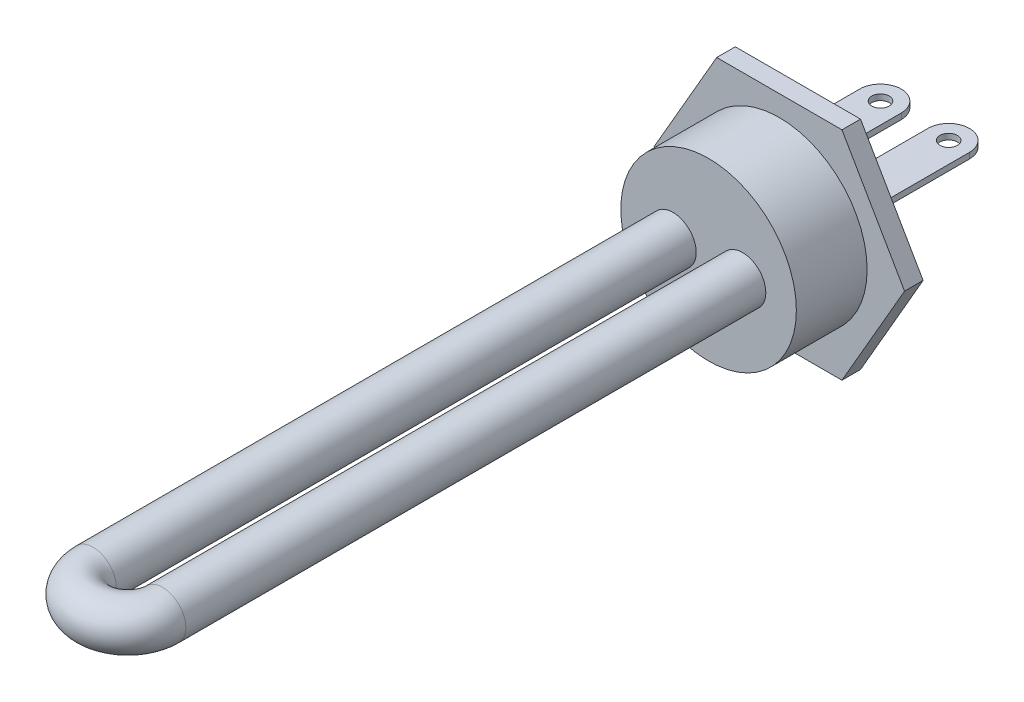
ISO-10303-21;
HEADER;
FILE_DESCRIPTION(('STEP AP214'),'2;1');
FILE_NAME('part.step','',(''),(''),'','','');
FILE_SCHEMA(('AUTOMOTIVE_DESIGN { 1 0 10303 214 1 1 1 1 }'));
ENDSEC;
DATA;
#1=APPLICATION_CONTEXT('core data for automotive mechanical design processes');
#2=APPLICATION_PROTOCOL_DEFINITION('international standard','automotive_design',2000,#1);
#3=PRODUCT_CONTEXT('',#1,'mechanical');
#4=PRODUCT('Part','Part','',(#3));
#5=PRODUCT_RELATED_PRODUCT_CATEGORY('part','',(#4));
#6=PRODUCT_DEFINITION_FORMATION('','',#4);
#7=PRODUCT_DEFINITION_CONTEXT('part definition',#1,'design');
#8=PRODUCT_DEFINITION('design','',#6,#7);
#9=PRODUCT_DEFINITION_SHAPE('','',#8);
#10=(LENGTH_UNIT() NAMED_UNIT(*) SI_UNIT(.MILLI.,.METRE.));
#11=(NAMED_UNIT(*) PLANE_ANGLE_UNIT() SI_UNIT($,.RADIAN.));
#12=(NAMED_UNIT(*) SI_UNIT($,.STERADIAN.) SOLID_ANGLE_UNIT());
#13=UNCERTAINTY_MEASURE_WITH_UNIT(LENGTH_MEASURE(1.E-05),#10,'distance_accuracy_value','');
#14=(GEOMETRIC_REPRESENTATION_CONTEXT(3) GLOBAL_UNCERTAINTY_ASSIGNED_CONTEXT((#13)) GLOBAL_UNIT_ASSIGNED_CONTEXT((#10,
#11,#12)) REPRESENTATION_CONTEXT('',''));
#15=CARTESIAN_POINT('',(0.,0.,0.));
#16=DIRECTION('',(0.,0.,1.));
#17=DIRECTION('',(1.,0.,0.));
#18=AXIS2_PLACEMENT_3D('',#15,#16,#17);
#19=CARTESIAN_POINT('',(9.46,2.,-23.7));
#20=DIRECTION('',(0.,1.,0.));
#21=DIRECTION('',(0.,0.,1.));
#22=AXIS2_PLACEMENT_3D('',#19,#20,#21);
#23=PLANE('',#22);
#24=CARTESIAN_POINT('',(5.88,2.,-20.12));
#25=DIRECTION('',(0.,1.,0.));
#26=DIRECTION('',(0.,0.,1.));
#27=AXIS2_PLACEMENT_3D('',#24,#25,#26);
#28=CIRCLE('',#27,1.5);
#29=CARTESIAN_POINT('',(5.88,2.,-18.62));
#30=VERTEX_POINT('',#29);
#31=EDGE_CURVE('E867',#30,#30,#28,.T.);
#32=ORIENTED_EDGE('',*,*,#31,.T.);
#33=EDGE_LOOP('',(#32));
#34=FACE_BOUND('',#33,.T.);
#35=CARTESIAN_POINT('',(5.88,2.,-20.12));
#36=DIRECTION('',(0.,1.,0.));
#37=DIRECTION('',(0.,0.,1.));
#38=AXIS2_PLACEMENT_3D('',#35,#36,#37);
#39=CIRCLE('',#38,3.58);
#40=CARTESIAN_POINT('',(9.46,2.,-20.12));
#41=VERTEX_POINT('',#40);
#42=CARTESIAN_POINT('',(2.3,2.,-20.12));
#43=VERTEX_POINT('',#42);
#44=EDGE_CURVE('E870',#41,#43,#39,.T.);
#45=ORIENTED_EDGE('',*,*,#44,.F.);
#46=DIRECTION('',(0.,0.,1.));
#47=VECTOR('',#46,1.);
#48=CARTESIAN_POINT('',(9.46,2.,-23.7));
#49=LINE('',#48,#47);
#50=CARTESIAN_POINT('',(9.46,2.,-5.7));
#51=VERTEX_POINT('',#50);
#52=EDGE_CURVE('E336',#41,#51,#49,.T.);
#53=ORIENTED_EDGE('',*,*,#52,.T.);
#54=DIRECTION('',(-1.,0.,0.));
#55=VECTOR('',#54,1.);
#56=CARTESIAN_POINT('',(9.46,2.,-5.7));
#57=LINE('',#56,#55);
#58=CARTESIAN_POINT('',(9.44410603363466,2.,-5.7));
#59=VERTEX_POINT('',#58);
#60=EDGE_CURVE('E311',#51,#59,#57,.T.);
#61=ORIENTED_EDGE('',*,*,#60,.T.);
#62=CARTESIAN_POINT('',(2.3,2.,-5.7));
#63=VERTEX_POINT('',#62);
#64=EDGE_CURVE('E316',#59,#63,#57,.T.);
#65=ORIENTED_EDGE('',*,*,#64,.T.);
#66=DIRECTION('',(0.,0.,1.));
#67=VECTOR('',#66,1.);
#68=CARTESIAN_POINT('',(2.3,2.,-23.7));
#69=LINE('',#68,#67);
#70=EDGE_CURVE('E333',#43,#63,#69,.T.);
#71=ORIENTED_EDGE('',*,*,#70,.F.);
#72=EDGE_LOOP('',(#45,#53,#61,#65,#71));
#73=FACE_BOUND('',#72,.T.);
#74=ADVANCED_FACE('F137',(#34,#73),#23,.F.);
#75=CARTESIAN_POINT('',(9.46,3.,-23.7));
#76=DIRECTION('',(0.,-1.,0.));
#77=DIRECTION('',(0.,0.,-1.));
#78=AXIS2_PLACEMENT_3D('',#75,#76,#77);
#79=PLANE('',#78);
#80=CARTESIAN_POINT('',(5.88,3.,-20.12));
#81=DIRECTION('',(0.,1.,0.));
#82=DIRECTION('',(0.,0.,1.));
#83=AXIS2_PLACEMENT_3D('',#80,#81,#82);
#84=CIRCLE('',#83,1.5);
#85=CARTESIAN_POINT('',(5.88,3.,-18.62));
#86=VERTEX_POINT('',#85);
#87=EDGE_CURVE('E287',#86,#86,#84,.T.);
#88=ORIENTED_EDGE('',*,*,#87,.F.);
#89=EDGE_LOOP('',(#88));
#90=FACE_BOUND('',#89,.T.);
#91=DIRECTION('',(0.,0.,1.));
#92=VECTOR('',#91,1.);
#93=CARTESIAN_POINT('',(9.46,3.,-23.7));
#94=LINE('',#93,#92);
#95=CARTESIAN_POINT('',(9.46,3.,-20.12));
#96=VERTEX_POINT('',#95);
#97=CARTESIAN_POINT('',(9.46,3.,-5.7));
#98=VERTEX_POINT('',#97);
#99=EDGE_CURVE('E326',#96,#98,#94,.T.);
#100=ORIENTED_EDGE('',*,*,#99,.F.);
#101=CARTESIAN_POINT('',(5.88,3.,-20.12));
#102=DIRECTION('',(0.,1.,0.));
#103=DIRECTION('',(0.,0.,1.));
#104=AXIS2_PLACEMENT_3D('',#101,#102,#103);
#105=CIRCLE('',#104,3.58);
#106=CARTESIAN_POINT('',(2.3,3.,-20.12));
#107=VERTEX_POINT('',#106);
#108=EDGE_CURVE('E909',#96,#107,#105,.T.);
#109=ORIENTED_EDGE('',*,*,#108,.T.);
#110=DIRECTION('',(0.,0.,1.));
#111=VECTOR('',#110,1.);
#112=CARTESIAN_POINT('',(2.3,3.,-23.7));
#113=LINE('',#112,#111);
#114=CARTESIAN_POINT('',(2.3,3.,-5.7));
#115=VERTEX_POINT('',#114);
#116=EDGE_CURVE('E330',#107,#115,#113,.T.);
#117=ORIENTED_EDGE('',*,*,#116,.T.);
#118=DIRECTION('',(1.,0.,0.));
#119=VECTOR('',#118,1.);
#120=CARTESIAN_POINT('',(9.46,3.,-5.7));
#121=LINE('',#120,#119);
#122=CARTESIAN_POINT('',(3.07036227750358,3.,-5.7));
#123=VERTEX_POINT('',#122);
#124=EDGE_CURVE('E322',#115,#123,#121,.T.);
#125=ORIENTED_EDGE('',*,*,#124,.T.);
#126=CARTESIAN_POINT('',(8.65963772249642,3.,-5.7));
#127=VERTEX_POINT('',#126);
#128=EDGE_CURVE('E327',#123,#127,#121,.T.);
#129=ORIENTED_EDGE('',*,*,#128,.T.);
#130=EDGE_CURVE('E321',#127,#98,#121,.T.);
#131=ORIENTED_EDGE('',*,*,#130,.T.);
#132=EDGE_LOOP('',(#100,#109,#117,#125,#129,#131));
#133=FACE_BOUND('',#132,.T.);
#134=ADVANCED_FACE('F532',(#90,#133),#79,.F.);
#135=CARTESIAN_POINT('',(-2.3,2.,-23.7));
#136=DIRECTION('',(0.,1.,0.));
#137=DIRECTION('',(0.,0.,1.));
#138=AXIS2_PLACEMENT_3D('',#135,#136,#137);
#139=PLANE('',#138);
#140=CARTESIAN_POINT('',(-5.88,2.,-20.12));
#141=DIRECTION('',(0.,1.,0.));
#142=DIRECTION('',(0.,0.,1.));
#143=AXIS2_PLACEMENT_3D('',#140,#141,#142);
#144=CIRCLE('',#143,1.5);
#145=CARTESIAN_POINT('',(-5.88,2.,-18.62));
#146=VERTEX_POINT('',#145);
#147=EDGE_CURVE('E877',#146,#146,#144,.T.);
#148=ORIENTED_EDGE('',*,*,#147,.T.);
#149=EDGE_LOOP('',(#148));
#150=FACE_BOUND('',#149,.T.);
#151=DIRECTION('',(0.,0.,1.));
#152=VECTOR('',#151,1.);
#153=CARTESIAN_POINT('',(-9.46,2.,-23.7));
#154=LINE('',#153,#152);
#155=CARTESIAN_POINT('',(-9.46,2.,-20.12));
#156=VERTEX_POINT('',#155);
#157=CARTESIAN_POINT('',(-9.46,2.,-5.7));
#158=VERTEX_POINT('',#157);
#159=EDGE_CURVE('E295',#156,#158,#154,.T.);
#160=ORIENTED_EDGE('',*,*,#159,.F.);
#161=CARTESIAN_POINT('',(-5.88,2.,-20.12));
#162=DIRECTION('',(0.,1.,0.));
#163=DIRECTION('',(0.,0.,1.));
#164=AXIS2_PLACEMENT_3D('',#161,#162,#163);
#165=CIRCLE('',#164,3.58);
#166=CARTESIAN_POINT('',(-2.3,2.,-20.12));
#167=VERTEX_POINT('',#166);
#168=EDGE_CURVE('E283',#167,#156,#165,.T.);
#169=ORIENTED_EDGE('',*,*,#168,.F.);
#170=DIRECTION('',(0.,0.,1.));
#171=VECTOR('',#170,1.);
#172=CARTESIAN_POINT('',(-2.3,2.,-23.7));
#173=LINE('',#172,#171);
#174=CARTESIAN_POINT('',(-2.3,2.,-5.7));
#175=VERTEX_POINT('',#174);
#176=EDGE_CURVE('E299',#167,#175,#173,.T.);
#177=ORIENTED_EDGE('',*,*,#176,.T.);
#178=DIRECTION('',(-1.,0.,0.));
#179=VECTOR('',#178,1.);
#180=CARTESIAN_POINT('',(-2.3,2.,-5.7));
#181=LINE('',#180,#179);
#182=CARTESIAN_POINT('',(-2.55589396636534,2.,-5.7));
#183=VERTEX_POINT('',#182);
#184=EDGE_CURVE('E875',#175,#183,#181,.T.);
#185=ORIENTED_EDGE('',*,*,#184,.T.);
#186=EDGE_CURVE('E153',#183,#158,#181,.T.);
#187=ORIENTED_EDGE('',*,*,#186,.T.);
#188=EDGE_LOOP('',(#160,#169,#177,#185,#187));
#189=FACE_BOUND('',#188,.T.);
#190=ADVANCED_FACE('F539',(#150,#189),#139,.F.);
#191=CARTESIAN_POINT('',(-2.3,3.,-23.7));
#192=DIRECTION('',(0.,-1.,0.));
#193=DIRECTION('',(0.,0.,-1.));
#194=AXIS2_PLACEMENT_3D('',#191,#192,#193);
#195=PLANE('',#194);
#196=CARTESIAN_POINT('',(-5.88,3.,-20.12));
#197=DIRECTION('',(0.,1.,0.));
#198=DIRECTION('',(0.,0.,1.));
#199=AXIS2_PLACEMENT_3D('',#196,#197,#198);
#200=CIRCLE('',#199,1.5);
#201=CARTESIAN_POINT('',(-5.88,3.,-18.62));
#202=VERTEX_POINT('',#201);
#203=EDGE_CURVE('E912',#202,#202,#200,.T.);
#204=ORIENTED_EDGE('',*,*,#203,.F.);
#205=EDGE_LOOP('',(#204));
#206=FACE_BOUND('',#205,.T.);
#207=CARTESIAN_POINT('',(-5.88,3.,-20.12));
#208=DIRECTION('',(0.,1.,0.));
#209=DIRECTION('',(0.,0.,1.));
#210=AXIS2_PLACEMENT_3D('',#207,#208,#209);
#211=CIRCLE('',#210,3.58);
#212=CARTESIAN_POINT('',(-2.3,3.,-20.12));
#213=VERTEX_POINT('',#212);
#214=CARTESIAN_POINT('',(-9.46,3.,-20.12));
#215=VERTEX_POINT('',#214);
#216=EDGE_CURVE('E264',#213,#215,#211,.T.);
#217=ORIENTED_EDGE('',*,*,#216,.T.);
#218=DIRECTION('',(0.,0.,1.));
#219=VECTOR('',#218,1.);
#220=CARTESIAN_POINT('',(-9.46,3.,-23.7));
#221=LINE('',#220,#219);
#222=CARTESIAN_POINT('',(-9.46,3.,-5.7));
#223=VERTEX_POINT('',#222);
#224=EDGE_CURVE('E269',#215,#223,#221,.T.);
#225=ORIENTED_EDGE('',*,*,#224,.T.);
#226=DIRECTION('',(1.,0.,0.));
#227=VECTOR('',#226,1.);
#228=CARTESIAN_POINT('',(-2.3,3.,-5.7));
#229=LINE('',#228,#227);
#230=CARTESIAN_POINT('',(-8.92963772249642,3.,-5.7));
#231=VERTEX_POINT('',#230);
#232=EDGE_CURVE('E301',#223,#231,#229,.T.);
#233=ORIENTED_EDGE('',*,*,#232,.T.);
#234=CARTESIAN_POINT('',(-3.34036227750357,3.,-5.7));
#235=VERTEX_POINT('',#234);
#236=EDGE_CURVE('E146',#231,#235,#229,.T.);
#237=ORIENTED_EDGE('',*,*,#236,.T.);
#238=CARTESIAN_POINT('',(-2.3,3.,-5.7));
#239=VERTEX_POINT('',#238);
#240=EDGE_CURVE('E886',#235,#239,#229,.T.);
#241=ORIENTED_EDGE('',*,*,#240,.T.);
#242=DIRECTION('',(0.,0.,1.));
#243=VECTOR('',#242,1.);
#244=CARTESIAN_POINT('',(-2.3,3.,-23.7));
#245=LINE('',#244,#243);
#246=EDGE_CURVE('E272',#213,#239,#245,.T.);
#247=ORIENTED_EDGE('',*,*,#246,.F.);
#248=EDGE_LOOP('',(#217,#225,#233,#237,#241,#247));
#249=FACE_BOUND('',#248,.T.);
#250=ADVANCED_FACE('F266',(#206,#249),#195,.F.);
#251=CARTESIAN_POINT('',(-9.46,3.,-23.7));
#252=DIRECTION('',(1.,0.,0.));
#253=DIRECTION('',(0.,0.,-1.));
#254=AXIS2_PLACEMENT_3D('',#251,#252,#253);
#255=PLANE('',#254);
#256=DIRECTION('',(0.,1.,0.));
#257=VECTOR('',#256,1.);
#258=CARTESIAN_POINT('',(-9.46,-18.7,-20.12));
#259=LINE('',#258,#257);
#260=EDGE_CURVE('E280',#156,#215,#259,.T.);
#261=ORIENTED_EDGE('',*,*,#260,.F.);
#262=ORIENTED_EDGE('',*,*,#159,.T.);
#263=DIRECTION('',(0.,1.,0.));
#264=VECTOR('',#263,1.);
#265=CARTESIAN_POINT('',(-9.46,3.,-5.7));
#266=LINE('',#265,#264);
#267=CARTESIAN_POINT('',(-9.46,2.39882783875792,-5.7));
#268=VERTEX_POINT('',#267);
#269=EDGE_CURVE('E884',#158,#268,#266,.T.);
#270=ORIENTED_EDGE('',*,*,#269,.T.);
#271=EDGE_CURVE('E292',#268,#223,#266,.T.);
#272=ORIENTED_EDGE('',*,*,#271,.T.);
#273=ORIENTED_EDGE('',*,*,#224,.F.);
#274=EDGE_LOOP('',(#261,#262,#270,#272,#273));
#275=FACE_BOUND('',#274,.T.);
#276=ADVANCED_FACE('F289',(#275),#255,.F.);
#277=CARTESIAN_POINT('',(2.3,3.,-23.7));
#278=DIRECTION('',(1.,0.,0.));
#279=DIRECTION('',(0.,0.,-1.));
#280=AXIS2_PLACEMENT_3D('',#277,#278,#279);
#281=PLANE('',#280);
#282=DIRECTION('',(0.,1.,0.));
#283=VECTOR('',#282,1.);
#284=CARTESIAN_POINT('',(2.3,-18.7,-20.12));
#285=LINE('',#284,#283);
#286=EDGE_CURVE('E277',#43,#107,#285,.T.);
#287=ORIENTED_EDGE('',*,*,#286,.F.);
#288=ORIENTED_EDGE('',*,*,#70,.T.);
#289=DIRECTION('',(0.,1.,0.));
#290=VECTOR('',#289,1.);
#291=CARTESIAN_POINT('',(2.3,3.,-5.7));
#292=LINE('',#291,#290);
#293=CARTESIAN_POINT('',(2.3,2.02503703669834,-5.7));
#294=VERTEX_POINT('',#293);
#295=EDGE_CURVE('E317',#63,#294,#292,.T.);
#296=ORIENTED_EDGE('',*,*,#295,.T.);
#297=EDGE_CURVE('E315',#294,#115,#292,.T.);
#298=ORIENTED_EDGE('',*,*,#297,.T.);
#299=ORIENTED_EDGE('',*,*,#116,.F.);
#300=EDGE_LOOP('',(#287,#288,#296,#298,#299));
#301=FACE_BOUND('',#300,.T.);
#302=ADVANCED_FACE('F546',(#301),#281,.F.);
#303=CARTESIAN_POINT('',(-6.135,0.,-5.7));
#304=DIRECTION('',(0.,0.,-1.));
#305=DIRECTION('',(-1.,0.,0.));
#306=AXIS2_PLACEMENT_3D('',#303,#304,#305);
#307=PLANE('',#306);
#308=ORIENTED_EDGE('',*,*,#236,.F.);
#309=CARTESIAN_POINT('',(-6.135,0.,-5.7));
#310=DIRECTION('',(0.,0.,-1.));
#311=DIRECTION('',(-1.,0.,0.));
#312=AXIS2_PLACEMENT_3D('',#309,#310,#311);
#313=CIRCLE('',#312,4.1);
#314=EDGE_CURVE('E345',#231,#235,#313,.T.);
#315=ORIENTED_EDGE('',*,*,#314,.T.);
#316=EDGE_LOOP('',(#308,#315));
#317=FACE_BOUND('',#316,.T.);
#318=ADVANCED_FACE('F558',(#317),#307,.T.);
#319=CARTESIAN_POINT('',(5.865,0.,-5.7));
#320=DIRECTION('',(0.,0.,-1.));
#321=DIRECTION('',(-1.,0.,0.));
#322=AXIS2_PLACEMENT_3D('',#319,#320,#321);
#323=PLANE('',#322);
#324=ORIENTED_EDGE('',*,*,#128,.F.);
#325=CARTESIAN_POINT('',(5.865,0.,-5.7));
#326=DIRECTION('',(0.,0.,-1.));
#327=DIRECTION('',(-1.,0.,0.));
#328=AXIS2_PLACEMENT_3D('',#325,#326,#327);
#329=CIRCLE('',#328,4.1);
#330=EDGE_CURVE('E355',#123,#127,#329,.T.);
#331=ORIENTED_EDGE('',*,*,#330,.T.);
#332=EDGE_LOOP('',(#324,#331));
#333=FACE_BOUND('',#332,.T.);
#334=ADVANCED_FACE('F571',(#333),#323,.T.);
#335=CARTESIAN_POINT('',(-10.796450033846,-18.7,3.2));
#336=DIRECTION('',(0.,1.,0.));
#337=DIRECTION('',(0.,0.,1.));
#338=AXIS2_PLACEMENT_3D('',#335,#336,#337);
#339=PLANE('',#338);
#340=DIRECTION('',(1.,0.,0.));
#341=VECTOR('',#340,1.);
#342=CARTESIAN_POINT('',(-10.796450033846,-18.7,0.));
#343=LINE('',#342,#341);
#344=CARTESIAN_POINT('',(-10.796450033846,-18.7,0.));
#345=VERTEX_POINT('',#344);
#346=CARTESIAN_POINT('',(10.796450033846,-18.7,0.));
#347=VERTEX_POINT('',#346);
#348=EDGE_CURVE('E396',#345,#347,#343,.T.);
#349=ORIENTED_EDGE('',*,*,#348,.T.);
#350=DIRECTION('',(0.,0.,-1.));
#351=VECTOR('',#350,1.);
#352=CARTESIAN_POINT('',(10.796450033846,-18.7,3.2));
#353=LINE('',#352,#351);
#354=CARTESIAN_POINT('',(10.796450033846,-18.7,3.2));
#355=VERTEX_POINT('',#354);
#356=EDGE_CURVE('E402',#355,#347,#353,.T.);
#357=ORIENTED_EDGE('',*,*,#356,.F.);
#358=DIRECTION('',(1.,0.,0.));
#359=VECTOR('',#358,1.);
#360=CARTESIAN_POINT('',(-10.796450033846,-18.7,3.2));
#361=LINE('',#360,#359);
#362=CARTESIAN_POINT('',(-10.796450033846,-18.7,3.2));
#363=VERTEX_POINT('',#362);
#364=EDGE_CURVE('E403',#363,#355,#361,.T.);
#365=ORIENTED_EDGE('',*,*,#364,.F.);
#366=DIRECTION('',(0.,0.,-1.));
#367=VECTOR('',#366,1.);
#368=CARTESIAN_POINT('',(-10.796450033846,-18.7,3.2));
#369=LINE('',#368,#367);
#370=EDGE_CURVE('E423',#363,#345,#369,.T.);
#371=ORIENTED_EDGE('',*,*,#370,.T.);
#372=EDGE_LOOP('',(#349,#357,#365,#371));
#373=FACE_BOUND('',#372,.T.);
#374=ADVANCED_FACE('F139',(#373),#339,.F.);
#375=CARTESIAN_POINT('',(10.796450033846,-18.7,3.2));
#376=DIRECTION('',(-0.866025403784438,0.5,0.));
#377=DIRECTION('',(-0.5,-0.866025403784439,0.));
#378=AXIS2_PLACEMENT_3D('',#375,#376,#377);
#379=PLANE('',#378);
#380=DIRECTION('',(0.5,0.866025403784438,0.));
#381=VECTOR('',#380,1.);
#382=CARTESIAN_POINT('',(10.796450033846,-18.7,0.));
#383=LINE('',#382,#381);
#384=CARTESIAN_POINT('',(21.592900067692,0.,0.));
#385=VERTEX_POINT('',#384);
#386=EDGE_CURVE('E427',#347,#385,#383,.T.);
#387=ORIENTED_EDGE('',*,*,#386,.T.);
#388=DIRECTION('',(0.,0.,-1.));
#389=VECTOR('',#388,1.);
#390=CARTESIAN_POINT('',(21.592900067692,0.,3.2));
#391=LINE('',#390,#389);
#392=CARTESIAN_POINT('',(21.592900067692,0.,3.2));
#393=VERTEX_POINT('',#392);
#394=EDGE_CURVE('E456',#393,#385,#391,.T.);
#395=ORIENTED_EDGE('',*,*,#394,.F.);
#396=DIRECTION('',(0.5,0.866025403784438,0.));
#397=VECTOR('',#396,1.);
#398=CARTESIAN_POINT('',(10.796450033846,-18.7,3.2));
#399=LINE('',#398,#397);
#400=EDGE_CURVE('E407',#355,#393,#399,.T.);
#401=ORIENTED_EDGE('',*,*,#400,.F.);
#402=ORIENTED_EDGE('',*,*,#356,.T.);
#403=EDGE_LOOP('',(#387,#395,#401,#402));
#404=FACE_BOUND('',#403,.T.);
#405=ADVANCED_FACE('F520',(#404),#379,.F.);
#406=CARTESIAN_POINT('',(21.592900067692,0.,3.2));
#407=DIRECTION('',(-0.866025403784438,-0.5,0.));
#408=DIRECTION('',(0.5,-0.866025403784439,0.));
#409=AXIS2_PLACEMENT_3D('',#406,#407,#408);
#410=PLANE('',#409);
#411=DIRECTION('',(-0.5,0.866025403784438,0.));
#412=VECTOR('',#411,1.);
#413=CARTESIAN_POINT('',(21.592900067692,0.,0.));
#414=LINE('',#413,#412);
#415=CARTESIAN_POINT('',(10.796450033846,18.7,0.));
#416=VERTEX_POINT('',#415);
#417=EDGE_CURVE('E430',#385,#416,#414,.T.);
#418=ORIENTED_EDGE('',*,*,#417,.T.);
#419=DIRECTION('',(0.,0.,-1.));
#420=VECTOR('',#419,1.);
#421=CARTESIAN_POINT('',(10.796450033846,18.7,3.2));
#422=LINE('',#421,#420);
#423=CARTESIAN_POINT('',(10.796450033846,18.7,3.2));
#424=VERTEX_POINT('',#423);
#425=EDGE_CURVE('E452',#424,#416,#422,.T.);
#426=ORIENTED_EDGE('',*,*,#425,.F.);
#427=DIRECTION('',(-0.5,0.866025403784438,0.));
#428=VECTOR('',#427,1.);
#429=CARTESIAN_POINT('',(21.592900067692,0.,3.2));
#430=LINE('',#429,#428);
#431=EDGE_CURVE('E411',#393,#424,#430,.T.);
#432=ORIENTED_EDGE('',*,*,#431,.F.);
#433=ORIENTED_EDGE('',*,*,#394,.T.);
#434=EDGE_LOOP('',(#418,#426,#432,#433));
#435=FACE_BOUND('',#434,.T.);
#436=ADVANCED_FACE('F517',(#435),#410,.F.);
#437=CARTESIAN_POINT('',(10.796450033846,18.7,3.2));
#438=DIRECTION('',(0.,-1.,0.));
#439=DIRECTION('',(0.,0.,-1.));
#440=AXIS2_PLACEMENT_3D('',#437,#438,#439);
#441=PLANE('',#440);
#442=DIRECTION('',(-1.,0.,0.));
#443=VECTOR('',#442,1.);
#444=CARTESIAN_POINT('',(10.796450033846,18.7,0.));
#445=LINE('',#444,#443);
#446=CARTESIAN_POINT('',(-10.796450033846,18.7,0.));
#447=VERTEX_POINT('',#446);
#448=EDGE_CURVE('E433',#416,#447,#445,.T.);
#449=ORIENTED_EDGE('',*,*,#448,.T.);
#450=DIRECTION('',(0.,0.,-1.));
#451=VECTOR('',#450,1.);
#452=CARTESIAN_POINT('',(-10.796450033846,18.7,3.2));
#453=LINE('',#452,#451);
#454=CARTESIAN_POINT('',(-10.796450033846,18.7,3.2));
#455=VERTEX_POINT('',#454);
#456=EDGE_CURVE('E448',#455,#447,#453,.T.);
#457=ORIENTED_EDGE('',*,*,#456,.F.);
#458=DIRECTION('',(-1.,0.,0.));
#459=VECTOR('',#458,1.);
#460=CARTESIAN_POINT('',(10.796450033846,18.7,3.2));
#461=LINE('',#460,#459);
#462=EDGE_CURVE('E414',#424,#455,#461,.T.);
#463=ORIENTED_EDGE('',*,*,#462,.F.);
#464=ORIENTED_EDGE('',*,*,#425,.T.);
#465=EDGE_LOOP('',(#449,#457,#463,#464));
#466=FACE_BOUND('',#465,.T.);
#467=ADVANCED_FACE('F512',(#466),#441,.F.);
#468=CARTESIAN_POINT('',(-10.796450033846,18.7,3.2));
#469=DIRECTION('',(0.866025403784439,-0.5,0.));
#470=DIRECTION('',(0.5,0.866025403784439,0.));
#471=AXIS2_PLACEMENT_3D('',#468,#469,#470);
#472=PLANE('',#471);
#473=DIRECTION('',(-0.5,-0.866025403784439,0.));
#474=VECTOR('',#473,1.);
#475=CARTESIAN_POINT('',(-10.796450033846,18.7,0.));
#476=LINE('',#475,#474);
#477=CARTESIAN_POINT('',(-21.592900067692,0.,0.));
#478=VERTEX_POINT('',#477);
#479=EDGE_CURVE('E436',#447,#478,#476,.T.);
#480=ORIENTED_EDGE('',*,*,#479,.T.);
#481=DIRECTION('',(0.,0.,-1.));
#482=VECTOR('',#481,1.);
#483=CARTESIAN_POINT('',(-21.592900067692,0.,3.2));
#484=LINE('',#483,#482);
#485=CARTESIAN_POINT('',(-21.592900067692,0.,3.2));
#486=VERTEX_POINT('',#485);
#487=EDGE_CURVE('E444',#486,#478,#484,.T.);
#488=ORIENTED_EDGE('',*,*,#487,.F.);
#489=DIRECTION('',(-0.5,-0.866025403784439,0.));
#490=VECTOR('',#489,1.);
#491=CARTESIAN_POINT('',(-10.796450033846,18.7,3.2));
#492=LINE('',#491,#490);
#493=EDGE_CURVE('E417',#455,#486,#492,.T.);
#494=ORIENTED_EDGE('',*,*,#493,.F.);
#495=ORIENTED_EDGE('',*,*,#456,.T.);
#496=EDGE_LOOP('',(#480,#488,#494,#495));
#497=FACE_BOUND('',#496,.T.);
#498=ADVANCED_FACE('F508',(#497),#472,.F.);
#499=CARTESIAN_POINT('',(-21.592900067692,0.,3.2));
#500=DIRECTION('',(0.866025403784439,0.5,0.));
#501=DIRECTION('',(-0.5,0.866025403784439,0.));
#502=AXIS2_PLACEMENT_3D('',#499,#500,#501);
#503=PLANE('',#502);
#504=DIRECTION('',(0.5,-0.866025403784439,0.));
#505=VECTOR('',#504,1.);
#506=CARTESIAN_POINT('',(-21.592900067692,0.,0.));
#507=LINE('',#506,#505);
#508=EDGE_CURVE('E408',#478,#345,#507,.T.);
#509=ORIENTED_EDGE('',*,*,#508,.T.);
#510=ORIENTED_EDGE('',*,*,#370,.F.);
#511=DIRECTION('',(0.5,-0.866025403784439,0.));
#512=VECTOR('',#511,1.);
#513=CARTESIAN_POINT('',(-21.592900067692,0.,3.2));
#514=LINE('',#513,#512);
#515=EDGE_CURVE('E420',#486,#363,#514,.T.);
#516=ORIENTED_EDGE('',*,*,#515,.F.);
#517=ORIENTED_EDGE('',*,*,#487,.T.);
#518=EDGE_LOOP('',(#509,#510,#516,#517));
#519=FACE_BOUND('',#518,.T.);
#520=ADVANCED_FACE('F504',(#519),#503,.F.);
#521=CARTESIAN_POINT('',(0.,0.,3.2));
#522=DIRECTION('',(0.,0.,1.));
#523=DIRECTION('',(1.,0.,0.));
#524=AXIS2_PLACEMENT_3D('',#521,#522,#523);
#525=PLANE('',#524);
#526=CARTESIAN_POINT('',(0.,0.,3.2));
#527=DIRECTION('',(0.,0.,1.));
#528=DIRECTION('',(1.,0.,0.));
#529=AXIS2_PLACEMENT_3D('',#526,#527,#528);
#530=CIRCLE('',#529,15.135);
#531=CARTESIAN_POINT('',(15.135,0.,3.2));
#532=VERTEX_POINT('',#531);
#533=EDGE_CURVE('E397',#532,#532,#530,.T.);
#534=ORIENTED_EDGE('',*,*,#533,.F.);
#535=EDGE_LOOP('',(#534));
#536=FACE_BOUND('',#535,.T.);
#537=ORIENTED_EDGE('',*,*,#364,.T.);
#538=ORIENTED_EDGE('',*,*,#400,.T.);
#539=ORIENTED_EDGE('',*,*,#431,.T.);
#540=ORIENTED_EDGE('',*,*,#462,.T.);
#541=ORIENTED_EDGE('',*,*,#493,.T.);
#542=ORIENTED_EDGE('',*,*,#515,.T.);
#543=EDGE_LOOP('',(#537,#538,#539,#540,#541,#542));
#544=FACE_BOUND('',#543,.T.);
#545=ADVANCED_FACE('F492',(#536,#544),#525,.T.);
#546=CARTESIAN_POINT('',(0.,0.,0.));
#547=DIRECTION('',(0.,0.,1.));
#548=DIRECTION('',(1.,0.,0.));
#549=AXIS2_PLACEMENT_3D('',#546,#547,#548);
#550=PLANE('',#549);
#551=CARTESIAN_POINT('',(0.,0.,0.));
#552=DIRECTION('',(0.,0.,-1.));
#553=DIRECTION('',(-1.,0.,0.));
#554=AXIS2_PLACEMENT_3D('',#551,#552,#553);
#555=CIRCLE('',#554,13.5);
#556=CARTESIAN_POINT('',(-13.5,0.,0.));
#557=VERTEX_POINT('',#556);
#558=EDGE_CURVE('E375',#557,#557,#555,.T.);
#559=ORIENTED_EDGE('',*,*,#558,.F.);
#560=EDGE_LOOP('',(#559));
#561=FACE_BOUND('',#560,.T.);
#562=ORIENTED_EDGE('',*,*,#348,.F.);
#563=ORIENTED_EDGE('',*,*,#508,.F.);
#564=ORIENTED_EDGE('',*,*,#479,.F.);
#565=ORIENTED_EDGE('',*,*,#448,.F.);
#566=ORIENTED_EDGE('',*,*,#417,.F.);
#567=ORIENTED_EDGE('',*,*,#386,.F.);
#568=EDGE_LOOP('',(#562,#563,#564,#565,#566,#567));
#569=FACE_BOUND('',#568,.T.);
#570=ADVANCED_FACE('F488',(#561,#569),#550,.F.);
#571=CARTESIAN_POINT('',(0.,0.,15.4));
#572=DIRECTION('',(0.,0.,-1.));
#573=DIRECTION('',(-1.,0.,0.));
#574=AXIS2_PLACEMENT_3D('',#571,#572,#573);
#575=CYLINDRICAL_SURFACE('',#574,15.135);
#576=CARTESIAN_POINT('',(0.,0.,15.4));
#577=DIRECTION('',(0.,0.,1.));
#578=DIRECTION('',(1.,0.,0.));
#579=AXIS2_PLACEMENT_3D('',#576,#577,#578);
#580=CIRCLE('',#579,15.135);
#581=CARTESIAN_POINT('',(15.135,0.,15.4));
#582=VERTEX_POINT('',#581);
#583=EDGE_CURVE('E389',#582,#582,#580,.T.);
#584=ORIENTED_EDGE('',*,*,#583,.F.);
#585=EDGE_LOOP('',(#584));
#586=FACE_BOUND('',#585,.T.);
#587=ORIENTED_EDGE('',*,*,#533,.T.);
#588=EDGE_LOOP('',(#587));
#589=FACE_BOUND('',#588,.T.);
#590=ADVANCED_FACE('F491',(#586,#589),#575,.T.);
#591=CARTESIAN_POINT('',(0.,0.,15.4));
#592=DIRECTION('',(0.,0.,1.));
#593=DIRECTION('',(1.,0.,0.));
#594=AXIS2_PLACEMENT_3D('',#591,#592,#593);
#595=PLANE('',#594);
#596=CARTESIAN_POINT('',(5.865,0.,15.4));
#597=DIRECTION('',(0.,0.,1.));
#598=DIRECTION('',(1.,0.,0.));
#599=AXIS2_PLACEMENT_3D('',#596,#597,#598);
#600=CIRCLE('',#599,4.);
#601=CARTESIAN_POINT('',(9.865,0.,15.4));
#602=VERTEX_POINT('',#601);
#603=EDGE_CURVE('E380',#602,#602,#600,.T.);
#604=ORIENTED_EDGE('',*,*,#603,.F.);
#605=EDGE_LOOP('',(#604));
#606=FACE_BOUND('',#605,.T.);
#607=CARTESIAN_POINT('',(-6.135,0.,15.4));
#608=DIRECTION('',(0.,0.,1.));
#609=DIRECTION('',(1.,0.,0.));
#610=AXIS2_PLACEMENT_3D('',#607,#608,#609);
#611=CIRCLE('',#610,4.);
#612=CARTESIAN_POINT('',(-2.135,0.,15.4));
#613=VERTEX_POINT('',#612);
#614=EDGE_CURVE('E376',#613,#613,#611,.T.);
#615=ORIENTED_EDGE('',*,*,#614,.F.);
#616=EDGE_LOOP('',(#615));
#617=FACE_BOUND('',#616,.T.);
#618=ORIENTED_EDGE('',*,*,#583,.T.);
#619=EDGE_LOOP('',(#618));
#620=FACE_BOUND('',#619,.T.);
#621=ADVANCED_FACE('F484',(#606,#617,#620),#595,.T.);
#622=CARTESIAN_POINT('',(0.,0.,12.8));
#623=DIRECTION('',(0.,0.,-1.));
#624=DIRECTION('',(-1.,0.,0.));
#625=AXIS2_PLACEMENT_3D('',#622,#623,#624);
#626=CYLINDRICAL_SURFACE('',#625,13.5);
#627=CARTESIAN_POINT('',(0.,0.,12.8));
#628=DIRECTION('',(0.,0.,-1.));
#629=DIRECTION('',(-1.,0.,0.));
#630=AXIS2_PLACEMENT_3D('',#627,#628,#629);
#631=CIRCLE('',#630,13.5);
#632=CARTESIAN_POINT('',(-13.5,0.,12.8));
#633=VERTEX_POINT('',#632);
#634=EDGE_CURVE('E385',#633,#633,#631,.T.);
#635=ORIENTED_EDGE('',*,*,#634,.F.);
#636=EDGE_LOOP('',(#635));
#637=FACE_BOUND('',#636,.T.);
#638=ORIENTED_EDGE('',*,*,#558,.T.);
#639=EDGE_LOOP('',(#638));
#640=FACE_BOUND('',#639,.T.);
#641=ADVANCED_FACE('F476',(#637,#640),#626,.F.);
#642=CARTESIAN_POINT('',(0.,0.,12.8));
#643=DIRECTION('',(0.,0.,-1.));
#644=DIRECTION('',(-1.,0.,0.));
#645=AXIS2_PLACEMENT_3D('',#642,#643,#644);
#646=PLANE('',#645);
#647=CARTESIAN_POINT('',(5.865,0.,12.8));
#648=DIRECTION('',(0.,0.,-1.));
#649=DIRECTION('',(-1.,0.,0.));
#650=AXIS2_PLACEMENT_3D('',#647,#648,#649);
#651=CIRCLE('',#650,4.);
#652=CARTESIAN_POINT('',(1.865,0.,12.8));
#653=VERTEX_POINT('',#652);
#654=EDGE_CURVE('E381',#653,#653,#651,.T.);
#655=ORIENTED_EDGE('',*,*,#654,.F.);
#656=EDGE_LOOP('',(#655));
#657=FACE_BOUND('',#656,.T.);
#658=CARTESIAN_POINT('',(-6.135,0.,12.8));
#659=DIRECTION('',(0.,0.,-1.));
#660=DIRECTION('',(-1.,0.,0.));
#661=AXIS2_PLACEMENT_3D('',#658,#659,#660);
#662=CIRCLE('',#661,4.);
#663=CARTESIAN_POINT('',(-10.135,0.,12.8));
#664=VERTEX_POINT('',#663);
#665=EDGE_CURVE('E401',#664,#664,#662,.T.);
#666=ORIENTED_EDGE('',*,*,#665,.F.);
#667=EDGE_LOOP('',(#666));
#668=FACE_BOUND('',#667,.T.);
#669=ORIENTED_EDGE('',*,*,#634,.T.);
#670=EDGE_LOOP('',(#669));
#671=FACE_BOUND('',#670,.T.);
#672=ADVANCED_FACE('F472',(#657,#668,#671),#646,.T.);
#673=CARTESIAN_POINT('',(-6.13499999999999,0.,115.4));
#674=DIRECTION('',(0.,0.,-1.));
#675=DIRECTION('',(-1.,0.,0.));
#676=AXIS2_PLACEMENT_3D('',#673,#674,#675);
#677=CYLINDRICAL_SURFACE('',#676,4.);
#678=ORIENTED_EDGE('',*,*,#665,.T.);
#679=EDGE_LOOP('',(#678));
#680=FACE_BOUND('',#679,.T.);
#681=CARTESIAN_POINT('',(-6.135,0.,0.));
#682=DIRECTION('',(0.,0.,-1.));
#683=DIRECTION('',(-1.,0.,0.));
#684=AXIS2_PLACEMENT_3D('',#681,#682,#683);
#685=CIRCLE('',#684,4.);
#686=CARTESIAN_POINT('',(-10.135,0.,0.));
#687=VERTEX_POINT('',#686);
#688=EDGE_CURVE('E371',#687,#687,#685,.T.);
#689=ORIENTED_EDGE('',*,*,#688,.F.);
#690=EDGE_LOOP('',(#689));
#691=FACE_BOUND('',#690,.T.);
#692=ADVANCED_FACE('F475',(#680,#691),#677,.T.);
#693=CARTESIAN_POINT('',(5.865,0.,0.));
#694=DIRECTION('',(0.,0.,1.));
#695=DIRECTION('',(1.,0.,0.));
#696=AXIS2_PLACEMENT_3D('',#693,#694,#695);
#697=CYLINDRICAL_SURFACE('',#696,4.);
#698=ORIENTED_EDGE('',*,*,#654,.T.);
#699=EDGE_LOOP('',(#698));
#700=FACE_BOUND('',#699,.T.);
#701=CARTESIAN_POINT('',(5.865,0.,0.));
#702=DIRECTION('',(0.,0.,1.));
#703=DIRECTION('',(1.,0.,0.));
#704=AXIS2_PLACEMENT_3D('',#701,#702,#703);
#705=CIRCLE('',#704,4.);
#706=CARTESIAN_POINT('',(9.865,0.,0.));
#707=VERTEX_POINT('',#706);
#708=EDGE_CURVE('E354',#707,#707,#705,.T.);
#709=ORIENTED_EDGE('',*,*,#708,.T.);
#710=EDGE_LOOP('',(#709));
#711=FACE_BOUND('',#710,.T.);
#712=ADVANCED_FACE('F469',(#700,#711),#697,.T.);
#713=ORIENTED_EDGE('',*,*,#603,.T.);
#714=EDGE_LOOP('',(#713));
#715=FACE_BOUND('',#714,.T.);
#716=CARTESIAN_POINT('',(5.86500000000002,0.,115.4));
#717=DIRECTION('',(0.,0.,1.));
#718=DIRECTION('',(1.,0.,0.));
#719=AXIS2_PLACEMENT_3D('',#716,#717,#718);
#720=CIRCLE('',#719,4.);
#721=CARTESIAN_POINT('',(9.86500000000001,0.,115.4));
#722=VERTEX_POINT('',#721);
#723=EDGE_CURVE('E363',#722,#722,#720,.T.);
#724=ORIENTED_EDGE('',*,*,#723,.F.);
#725=EDGE_LOOP('',(#724));
#726=FACE_BOUND('',#725,.T.);
#727=ADVANCED_FACE('F581',(#715,#726),#697,.T.);
#728=ORIENTED_EDGE('',*,*,#614,.T.);
#729=EDGE_LOOP('',(#728));
#730=FACE_BOUND('',#729,.T.);
#731=CARTESIAN_POINT('',(-6.13499999999999,0.,115.4));
#732=DIRECTION('',(0.,0.,-1.));
#733=DIRECTION('',(-1.,0.,0.));
#734=AXIS2_PLACEMENT_3D('',#731,#732,#733);
#735=CIRCLE('',#734,4.);
#736=CARTESIAN_POINT('',(-10.135,0.,115.4));
#737=VERTEX_POINT('',#736);
#738=EDGE_CURVE('E367',#737,#737,#735,.T.);
#739=ORIENTED_EDGE('',*,*,#738,.T.);
#740=EDGE_LOOP('',(#739));
#741=FACE_BOUND('',#740,.T.);
#742=ADVANCED_FACE('F584',(#730,#741),#677,.T.);
#743=CARTESIAN_POINT('',(-0.134999999999986,0.,115.4));
#744=DIRECTION('',(0.,-1.,0.));
#745=DIRECTION('',(0.,0.,-1.));
#746=AXIS2_PLACEMENT_3D('',#743,#744,#745);
#747=TOROIDAL_SURFACE('',#746,6.,4.);
#748=CARTESIAN_POINT('',(-0.134999999999986,0.,115.4));
#749=DIRECTION('',(0.,-1.,0.));
#750=DIRECTION('',(0.,0.,-1.));
#751=AXIS2_PLACEMENT_3D('',#748,#749,#750);
#752=CIRCLE('',#751,10.);
#753=EDGE_CURVE('',#722,#737,#752,.T.);
#754=ORIENTED_EDGE('',*,*,#723,.T.);
#755=ORIENTED_EDGE('',*,*,#738,.F.);
#756=ORIENTED_EDGE('',*,*,#753,.T.);
#757=ORIENTED_EDGE('',*,*,#753,.F.);
#758=EDGE_LOOP('',(#754,#756,#755,#757));
#759=FACE_BOUND('',#758,.T.);
#760=ADVANCED_FACE('F577',(#759),#747,.T.);
#761=CARTESIAN_POINT('',(5.865,0.,-5.7));
#762=DIRECTION('',(0.,0.,1.));
#763=DIRECTION('',(1.,0.,0.));
#764=AXIS2_PLACEMENT_3D('',#761,#762,#763);
#765=CYLINDRICAL_SURFACE('',#764,4.1);
#766=EDGE_CURVE('E350',#294,#123,#329,.T.);
#767=ORIENTED_EDGE('',*,*,#766,.F.);
#768=EDGE_CURVE('E356',#59,#294,#329,.T.);
#769=ORIENTED_EDGE('',*,*,#768,.F.);
#770=EDGE_CURVE('E940',#127,#59,#329,.T.);
#771=ORIENTED_EDGE('',*,*,#770,.F.);
#772=ORIENTED_EDGE('',*,*,#330,.F.);
#773=EDGE_LOOP('',(#767,#769,#771,#772));
#774=FACE_BOUND('',#773,.T.);
#775=CARTESIAN_POINT('',(5.865,0.,0.));
#776=DIRECTION('',(0.,0.,-1.));
#777=DIRECTION('',(-1.,0.,0.));
#778=AXIS2_PLACEMENT_3D('',#775,#776,#777);
#779=CIRCLE('',#778,4.1);
#780=CARTESIAN_POINT('',(1.765,0.,0.));
#781=VERTEX_POINT('',#780);
#782=EDGE_CURVE('E344',#781,#781,#779,.T.);
#783=ORIENTED_EDGE('',*,*,#782,.T.);
#784=EDGE_LOOP('',(#783));
#785=FACE_BOUND('',#784,.T.);
#786=ADVANCED_FACE('F569',(#774,#785),#765,.T.);
#787=ORIENTED_EDGE('',*,*,#295,.F.);
#788=ORIENTED_EDGE('',*,*,#64,.F.);
#789=ORIENTED_EDGE('',*,*,#768,.T.);
#790=EDGE_LOOP('',(#787,#788,#789));
#791=FACE_BOUND('',#790,.T.);
#792=ADVANCED_FACE('F566',(#791),#323,.T.);
#793=CARTESIAN_POINT('',(5.865,0.,0.));
#794=DIRECTION('',(0.,0.,-1.));
#795=DIRECTION('',(-1.,0.,0.));
#796=AXIS2_PLACEMENT_3D('',#793,#794,#795);
#797=PLANE('',#796);
#798=ORIENTED_EDGE('',*,*,#708,.F.);
#799=EDGE_LOOP('',(#798));
#800=FACE_BOUND('',#799,.T.);
#801=ORIENTED_EDGE('',*,*,#782,.F.);
#802=EDGE_LOOP('',(#801));
#803=FACE_BOUND('',#802,.T.);
#804=ADVANCED_FACE('F565',(#800,#803),#797,.F.);
#805=CARTESIAN_POINT('',(-6.135,0.,-5.7));
#806=DIRECTION('',(0.,0.,1.));
#807=DIRECTION('',(1.,0.,0.));
#808=AXIS2_PLACEMENT_3D('',#805,#806,#807);
#809=CYLINDRICAL_SURFACE('',#808,4.1);
#810=EDGE_CURVE('E340',#268,#231,#313,.T.);
#811=ORIENTED_EDGE('',*,*,#810,.F.);
#812=EDGE_CURVE('E346',#183,#268,#313,.T.);
#813=ORIENTED_EDGE('',*,*,#812,.F.);
#814=EDGE_CURVE('E160',#235,#183,#313,.T.);
#815=ORIENTED_EDGE('',*,*,#814,.F.);
#816=ORIENTED_EDGE('',*,*,#314,.F.);
#817=EDGE_LOOP('',(#811,#813,#815,#816));
#818=FACE_BOUND('',#817,.T.);
#819=CARTESIAN_POINT('',(-6.135,0.,0.));
#820=DIRECTION('',(0.,0.,-1.));
#821=DIRECTION('',(-1.,0.,0.));
#822=AXIS2_PLACEMENT_3D('',#819,#820,#821);
#823=CIRCLE('',#822,4.1);
#824=CARTESIAN_POINT('',(-10.235,0.,0.));
#825=VERTEX_POINT('',#824);
#826=EDGE_CURVE('E339',#825,#825,#823,.T.);
#827=ORIENTED_EDGE('',*,*,#826,.T.);
#828=EDGE_LOOP('',(#827));
#829=FACE_BOUND('',#828,.T.);
#830=ADVANCED_FACE('F557',(#818,#829),#809,.T.);
#831=ORIENTED_EDGE('',*,*,#269,.F.);
#832=ORIENTED_EDGE('',*,*,#186,.F.);
#833=ORIENTED_EDGE('',*,*,#812,.T.);
#834=EDGE_LOOP('',(#831,#832,#833));
#835=FACE_BOUND('',#834,.T.);
#836=ADVANCED_FACE('F553',(#835),#307,.T.);
#837=CARTESIAN_POINT('',(-6.135,0.,0.));
#838=DIRECTION('',(0.,0.,-1.));
#839=DIRECTION('',(-1.,0.,0.));
#840=AXIS2_PLACEMENT_3D('',#837,#838,#839);
#841=PLANE('',#840);
#842=ORIENTED_EDGE('',*,*,#688,.T.);
#843=EDGE_LOOP('',(#842));
#844=FACE_BOUND('',#843,.T.);
#845=ORIENTED_EDGE('',*,*,#826,.F.);
#846=EDGE_LOOP('',(#845));
#847=FACE_BOUND('',#846,.T.);
#848=ADVANCED_FACE('F556',(#844,#847),#841,.F.);
#849=CARTESIAN_POINT('',(0.,0.,-5.7));
#850=DIRECTION('',(0.,0.,-1.));
#851=DIRECTION('',(-1.,0.,0.));
#852=AXIS2_PLACEMENT_3D('',#849,#850,#851);
#853=PLANE('',#852);
#854=ORIENTED_EDGE('',*,*,#297,.F.);
#855=ORIENTED_EDGE('',*,*,#766,.T.);
#856=ORIENTED_EDGE('',*,*,#124,.F.);
#857=EDGE_LOOP('',(#854,#855,#856));
#858=FACE_BOUND('',#857,.T.);
#859=ADVANCED_FACE('F561',(#858),#853,.F.);
#860=ORIENTED_EDGE('',*,*,#130,.F.);
#861=ORIENTED_EDGE('',*,*,#770,.T.);
#862=ORIENTED_EDGE('',*,*,#60,.F.);
#863=DIRECTION('',(0.,-1.,0.));
#864=VECTOR('',#863,1.);
#865=CARTESIAN_POINT('',(9.46,3.,-5.7));
#866=LINE('',#865,#864);
#867=EDGE_CURVE('E307',#98,#51,#866,.T.);
#868=ORIENTED_EDGE('',*,*,#867,.F.);
#869=EDGE_LOOP('',(#860,#861,#862,#868));
#870=FACE_BOUND('',#869,.T.);
#871=ADVANCED_FACE('F551',(#870),#853,.F.);
#872=CARTESIAN_POINT('',(9.46,3.,-23.7));
#873=DIRECTION('',(-1.,0.,0.));
#874=DIRECTION('',(0.,0.,1.));
#875=AXIS2_PLACEMENT_3D('',#872,#873,#874);
#876=PLANE('',#875);
#877=ORIENTED_EDGE('',*,*,#52,.F.);
#878=DIRECTION('',(0.,1.,0.));
#879=VECTOR('',#878,1.);
#880=CARTESIAN_POINT('',(9.46,-18.7,-20.12));
#881=LINE('',#880,#879);
#882=EDGE_CURVE('E12',#41,#96,#881,.T.);
#883=ORIENTED_EDGE('',*,*,#882,.T.);
#884=ORIENTED_EDGE('',*,*,#99,.T.);
#885=ORIENTED_EDGE('',*,*,#867,.T.);
#886=EDGE_LOOP('',(#877,#883,#884,#885));
#887=FACE_BOUND('',#886,.T.);
#888=ADVANCED_FACE('F547',(#887),#876,.F.);
#889=CARTESIAN_POINT('',(0.,0.,-5.7));
#890=DIRECTION('',(0.,0.,-1.));
#891=DIRECTION('',(-1.,0.,0.));
#892=AXIS2_PLACEMENT_3D('',#889,#890,#891);
#893=PLANE('',#892);
#894=ORIENTED_EDGE('',*,*,#271,.F.);
#895=ORIENTED_EDGE('',*,*,#810,.T.);
#896=ORIENTED_EDGE('',*,*,#232,.F.);
#897=EDGE_LOOP('',(#894,#895,#896));
#898=FACE_BOUND('',#897,.T.);
#899=ADVANCED_FACE('F550',(#898),#893,.F.);
#900=ORIENTED_EDGE('',*,*,#240,.F.);
#901=ORIENTED_EDGE('',*,*,#814,.T.);
#902=ORIENTED_EDGE('',*,*,#184,.F.);
#903=DIRECTION('',(0.,-1.,0.));
#904=VECTOR('',#903,1.);
#905=CARTESIAN_POINT('',(-2.3,3.,-5.7));
#906=LINE('',#905,#904);
#907=EDGE_CURVE('E869',#239,#175,#906,.T.);
#908=ORIENTED_EDGE('',*,*,#907,.F.);
#909=EDGE_LOOP('',(#900,#901,#902,#908));
#910=FACE_BOUND('',#909,.T.);
#911=ADVANCED_FACE('F734',(#910),#893,.F.);
#912=CARTESIAN_POINT('',(-2.3,3.,-23.7));
#913=DIRECTION('',(-1.,0.,0.));
#914=DIRECTION('',(0.,0.,1.));
#915=AXIS2_PLACEMENT_3D('',#912,#913,#914);
#916=PLANE('',#915);
#917=ORIENTED_EDGE('',*,*,#176,.F.);
#918=DIRECTION('',(0.,1.,0.));
#919=VECTOR('',#918,1.);
#920=CARTESIAN_POINT('',(-2.3,-18.7,-20.12));
#921=LINE('',#920,#919);
#922=EDGE_CURVE('E276',#167,#213,#921,.T.);
#923=ORIENTED_EDGE('',*,*,#922,.T.);
#924=ORIENTED_EDGE('',*,*,#246,.T.);
#925=ORIENTED_EDGE('',*,*,#907,.T.);
#926=EDGE_LOOP('',(#917,#923,#924,#925));
#927=FACE_BOUND('',#926,.T.);
#928=ADVANCED_FACE('F744',(#927),#916,.F.);
#929=CARTESIAN_POINT('',(-5.88,-18.7,-20.12));
#930=DIRECTION('',(0.,1.,0.));
#931=DIRECTION('',(0.,0.,1.));
#932=AXIS2_PLACEMENT_3D('',#929,#930,#931);
#933=CYLINDRICAL_SURFACE('',#932,3.58);
#934=ORIENTED_EDGE('',*,*,#168,.T.);
#935=ORIENTED_EDGE('',*,*,#260,.T.);
#936=ORIENTED_EDGE('',*,*,#216,.F.);
#937=ORIENTED_EDGE('',*,*,#922,.F.);
#938=EDGE_LOOP('',(#934,#935,#936,#937));
#939=FACE_BOUND('',#938,.T.);
#940=ADVANCED_FACE('F281',(#939),#933,.T.);
#941=CARTESIAN_POINT('',(-5.88,-18.7,-20.12));
#942=DIRECTION('',(0.,1.,0.));
#943=DIRECTION('',(0.,0.,1.));
#944=AXIS2_PLACEMENT_3D('',#941,#942,#943);
#945=CYLINDRICAL_SURFACE('',#944,1.5);
#946=ORIENTED_EDGE('',*,*,#203,.T.);
#947=EDGE_LOOP('',(#946));
#948=FACE_BOUND('',#947,.T.);
#949=ORIENTED_EDGE('',*,*,#147,.F.);
#950=EDGE_LOOP('',(#949));
#951=FACE_BOUND('',#950,.T.);
#952=ADVANCED_FACE('F822',(#948,#951),#945,.F.);
#953=CARTESIAN_POINT('',(5.88,-18.7,-20.12));
#954=DIRECTION('',(0.,1.,0.));
#955=DIRECTION('',(0.,0.,1.));
#956=AXIS2_PLACEMENT_3D('',#953,#954,#955);
#957=CYLINDRICAL_SURFACE('',#956,3.58);
#958=ORIENTED_EDGE('',*,*,#44,.T.);
#959=ORIENTED_EDGE('',*,*,#286,.T.);
#960=ORIENTED_EDGE('',*,*,#108,.F.);
#961=ORIENTED_EDGE('',*,*,#882,.F.);
#962=EDGE_LOOP('',(#958,#959,#960,#961));
#963=FACE_BOUND('',#962,.T.);
#964=ADVANCED_FACE('F832',(#963),#957,.T.);
#965=CARTESIAN_POINT('',(5.88,-18.7,-20.12));
#966=DIRECTION('',(0.,1.,0.));
#967=DIRECTION('',(0.,0.,1.));
#968=AXIS2_PLACEMENT_3D('',#965,#966,#967);
#969=CYLINDRICAL_SURFACE('',#968,1.5);
#970=ORIENTED_EDGE('',*,*,#87,.T.);
#971=EDGE_LOOP('',(#970));
#972=FACE_BOUND('',#971,.T.);
#973=ORIENTED_EDGE('',*,*,#31,.F.);
#974=EDGE_LOOP('',(#973));
#975=FACE_BOUND('',#974,.T.);
#976=ADVANCED_FACE('F844',(#972,#975),#969,.F.);
#977=CLOSED_SHELL('',(#74,#134,#190,#250,#276,#302,#318,#334,#374,#405,#436,#467,#498,#520,#545,
#570,#590,#621,#641,#672,#692,#712,#727,#742,#760,#786,#792,#804,#830,#836,#848,#859,#871,#888,
#899,#911,#928,#940,#952,#964,#976));
#978=MANIFOLD_SOLID_BREP('B2',#977);
#979=ADVANCED_BREP_SHAPE_REPRESENTATION('',(#18,#978),#14);
#980=SHAPE_DEFINITION_REPRESENTATION(#9,#979);
ENDSEC;
END-ISO-10303-21;
